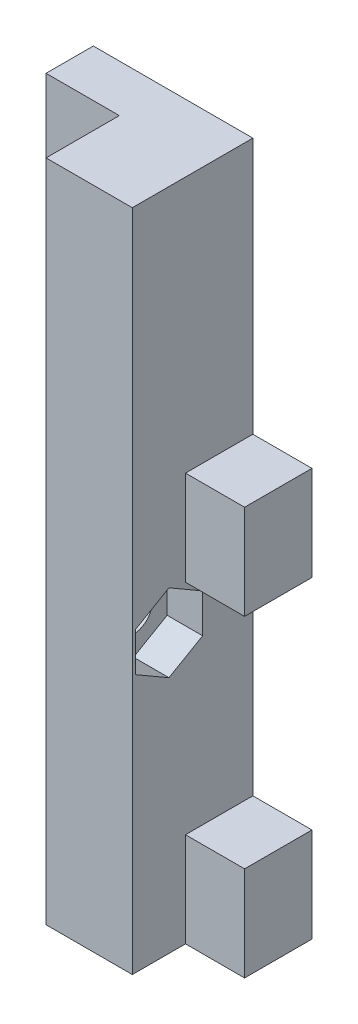
ISO-10303-21;
HEADER;
FILE_DESCRIPTION(('STEP AP214'),'2;1');
FILE_NAME('part.step','',(''),(''),'','','');
FILE_SCHEMA(('AUTOMOTIVE_DESIGN { 1 0 10303 214 1 1 1 1 }'));
ENDSEC;
DATA;
#1=APPLICATION_CONTEXT('core data for automotive mechanical design processes');
#2=APPLICATION_PROTOCOL_DEFINITION('international standard','automotive_design',2000,#1);
#3=PRODUCT_CONTEXT('',#1,'mechanical');
#4=PRODUCT('Part','Part','',(#3));
#5=PRODUCT_RELATED_PRODUCT_CATEGORY('part','',(#4));
#6=PRODUCT_DEFINITION_FORMATION('','',#4);
#7=PRODUCT_DEFINITION_CONTEXT('part definition',#1,'design');
#8=PRODUCT_DEFINITION('design','',#6,#7);
#9=PRODUCT_DEFINITION_SHAPE('','',#8);
#10=(LENGTH_UNIT() NAMED_UNIT(*) SI_UNIT(.MILLI.,.METRE.));
#11=(NAMED_UNIT(*) PLANE_ANGLE_UNIT() SI_UNIT($,.RADIAN.));
#12=(NAMED_UNIT(*) SI_UNIT($,.STERADIAN.) SOLID_ANGLE_UNIT());
#13=UNCERTAINTY_MEASURE_WITH_UNIT(LENGTH_MEASURE(1.E-05),#10,'distance_accuracy_value','');
#14=(GEOMETRIC_REPRESENTATION_CONTEXT(3) GLOBAL_UNCERTAINTY_ASSIGNED_CONTEXT((#13)) GLOBAL_UNIT_ASSIGNED_CONTEXT((#10,
#11,#12)) REPRESENTATION_CONTEXT('',''));
#15=CARTESIAN_POINT('',(0.,0.,0.));
#16=DIRECTION('',(0.,0.,1.));
#17=DIRECTION('',(1.,0.,0.));
#18=AXIS2_PLACEMENT_3D('',#15,#16,#17);
#19=CARTESIAN_POINT('',(0.,34.5,4.));
#20=DIRECTION('',(0.,-1.,0.));
#21=DIRECTION('',(0.,0.,-1.));
#22=AXIS2_PLACEMENT_3D('',#19,#20,#21);
#23=PLANE('',#22);
#24=DIRECTION('',(0.,0.,-1.));
#25=VECTOR('',#24,1.);
#26=CARTESIAN_POINT('',(13.5,34.5,5.7));
#27=LINE('',#26,#25);
#28=CARTESIAN_POINT('',(13.5,34.5,5.7));
#29=VERTEX_POINT('',#28);
#30=CARTESIAN_POINT('',(13.5,34.5,0.));
#31=VERTEX_POINT('',#30);
#32=EDGE_CURVE('E11',#29,#31,#27,.T.);
#33=ORIENTED_EDGE('',*,*,#32,.F.);
#34=DIRECTION('',(-1.,0.,0.));
#35=VECTOR('',#34,1.);
#36=CARTESIAN_POINT('',(18.5,34.5,5.7));
#37=LINE('',#36,#35);
#38=CARTESIAN_POINT('',(18.5,34.5,5.7));
#39=VERTEX_POINT('',#38);
#40=EDGE_CURVE('E400',#39,#29,#37,.T.);
#41=ORIENTED_EDGE('',*,*,#40,.F.);
#42=DIRECTION('',(0.,0.,-1.));
#43=VECTOR('',#42,1.);
#44=CARTESIAN_POINT('',(18.5,34.5,4.));
#45=LINE('',#44,#43);
#46=CARTESIAN_POINT('',(18.5,34.5,0.));
#47=VERTEX_POINT('',#46);
#48=EDGE_CURVE('E381',#39,#47,#45,.T.);
#49=ORIENTED_EDGE('',*,*,#48,.T.);
#50=DIRECTION('',(-1.,0.,0.));
#51=VECTOR('',#50,1.);
#52=CARTESIAN_POINT('',(0.,34.5,0.));
#53=LINE('',#52,#51);
#54=EDGE_CURVE('E175',#47,#31,#53,.T.);
#55=ORIENTED_EDGE('',*,*,#54,.T.);
#56=EDGE_LOOP('',(#33,#41,#49,#55));
#57=FACE_BOUND('',#56,.T.);
#58=ADVANCED_FACE('F31',(#57),#23,.F.);
#59=CARTESIAN_POINT('',(-0.00102500000000172,23.5,7.1));
#60=DIRECTION('',(1.,0.,0.));
#61=DIRECTION('',(0.,1.,0.));
#62=AXIS2_PLACEMENT_3D('',#59,#60,#61);
#63=CYLINDRICAL_SURFACE('',#62,1.6);
#64=CARTESIAN_POINT('',(6.2,23.5,7.1));
#65=DIRECTION('',(1.,0.,0.));
#66=DIRECTION('',(0.,1.,0.));
#67=AXIS2_PLACEMENT_3D('',#64,#65,#66);
#68=CIRCLE('',#67,1.6);
#69=CARTESIAN_POINT('',(6.2,25.1,7.1));
#70=VERTEX_POINT('',#69);
#71=EDGE_CURVE('E245',#70,#70,#68,.F.);
#72=ORIENTED_EDGE('',*,*,#71,.T.);
#73=EDGE_LOOP('',(#72));
#74=FACE_BOUND('',#73,.T.);
#75=CARTESIAN_POINT('',(10.5,23.5,7.1));
#76=DIRECTION('',(1.,0.,0.));
#77=DIRECTION('',(0.,0.,-1.));
#78=AXIS2_PLACEMENT_3D('',#75,#76,#77);
#79=CIRCLE('',#78,1.6);
#80=CARTESIAN_POINT('',(10.5,23.5,5.5));
#81=VERTEX_POINT('',#80);
#82=EDGE_CURVE('E234',#81,#81,#79,.F.);
#83=ORIENTED_EDGE('',*,*,#82,.F.);
#84=EDGE_LOOP('',(#83));
#85=FACE_BOUND('',#84,.T.);
#86=ADVANCED_FACE('F298',(#74,#85),#63,.F.);
#87=CARTESIAN_POINT('',(6.2,34.5,5.7));
#88=DIRECTION('',(0.,0.,1.));
#89=DIRECTION('',(1.,0.,0.));
#90=AXIS2_PLACEMENT_3D('',#87,#88,#89);
#91=PLANE('',#90);
#92=DIRECTION('',(0.,1.,0.));
#93=VECTOR('',#92,1.);
#94=CARTESIAN_POINT('',(13.5,0.,5.7));
#95=LINE('',#94,#93);
#96=CARTESIAN_POINT('',(13.5,0.,5.7));
#97=VERTEX_POINT('',#96);
#98=CARTESIAN_POINT('',(13.5,8.,5.7));
#99=VERTEX_POINT('',#98);
#100=EDGE_CURVE('E56',#97,#99,#95,.T.);
#101=ORIENTED_EDGE('',*,*,#100,.F.);
#102=DIRECTION('',(1.,0.,0.));
#103=VECTOR('',#102,1.);
#104=CARTESIAN_POINT('',(6.2,0.,5.7));
#105=LINE('',#104,#103);
#106=CARTESIAN_POINT('',(18.5,0.,5.7));
#107=VERTEX_POINT('',#106);
#108=EDGE_CURVE('E264',#97,#107,#105,.T.);
#109=ORIENTED_EDGE('',*,*,#108,.T.);
#110=DIRECTION('',(0.,1.,0.));
#111=VECTOR('',#110,1.);
#112=CARTESIAN_POINT('',(18.5,0.,5.7));
#113=LINE('',#112,#111);
#114=CARTESIAN_POINT('',(18.5,8.,5.7));
#115=VERTEX_POINT('',#114);
#116=EDGE_CURVE('E287',#107,#115,#113,.T.);
#117=ORIENTED_EDGE('',*,*,#116,.T.);
#118=DIRECTION('',(-1.,0.,0.));
#119=VECTOR('',#118,1.);
#120=CARTESIAN_POINT('',(18.5,8.,5.7));
#121=LINE('',#120,#119);
#122=EDGE_CURVE('E278',#115,#99,#121,.T.);
#123=ORIENTED_EDGE('',*,*,#122,.T.);
#124=EDGE_LOOP('',(#101,#109,#117,#123));
#125=FACE_BOUND('',#124,.T.);
#126=ADVANCED_FACE('F300',(#125),#91,.T.);
#127=CARTESIAN_POINT('',(0.,34.5,4.));
#128=DIRECTION('',(0.,0.,-1.));
#129=DIRECTION('',(-1.,0.,0.));
#130=AXIS2_PLACEMENT_3D('',#127,#128,#129);
#131=PLANE('',#130);
#132=DIRECTION('',(0.,-1.,0.));
#133=VECTOR('',#132,1.);
#134=CARTESIAN_POINT('',(6.2,34.5,4.));
#135=LINE('',#134,#133);
#136=CARTESIAN_POINT('',(6.2,56.2,4.));
#137=VERTEX_POINT('',#136);
#138=CARTESIAN_POINT('',(6.2,0.,4.));
#139=VERTEX_POINT('',#138);
#140=EDGE_CURVE('E181',#137,#139,#135,.T.);
#141=ORIENTED_EDGE('',*,*,#140,.F.);
#142=DIRECTION('',(1.,0.,0.));
#143=VECTOR('',#142,1.);
#144=CARTESIAN_POINT('',(0.,56.2,4.));
#145=LINE('',#144,#143);
#146=CARTESIAN_POINT('',(0.,56.2,4.));
#147=VERTEX_POINT('',#146);
#148=EDGE_CURVE('E178',#147,#137,#145,.T.);
#149=ORIENTED_EDGE('',*,*,#148,.F.);
#150=DIRECTION('',(0.,-1.,0.));
#151=VECTOR('',#150,1.);
#152=CARTESIAN_POINT('',(0.,0.,4.));
#153=LINE('',#152,#151);
#154=CARTESIAN_POINT('',(0.,0.,4.));
#155=VERTEX_POINT('',#154);
#156=EDGE_CURVE('E166',#147,#155,#153,.T.);
#157=ORIENTED_EDGE('',*,*,#156,.T.);
#158=DIRECTION('',(1.,0.,0.));
#159=VECTOR('',#158,1.);
#160=CARTESIAN_POINT('',(0.,0.,4.));
#161=LINE('',#160,#159);
#162=EDGE_CURVE('E174',#155,#139,#161,.T.);
#163=ORIENTED_EDGE('',*,*,#162,.T.);
#164=EDGE_LOOP('',(#141,#149,#157,#163));
#165=FACE_BOUND('',#164,.T.);
#166=ADVANCED_FACE('F179',(#165),#131,.F.);
#167=CARTESIAN_POINT('',(0.,0.,4.));
#168=DIRECTION('',(1.,0.,0.));
#169=DIRECTION('',(0.,0.,-1.));
#170=AXIS2_PLACEMENT_3D('',#167,#168,#169);
#171=PLANE('',#170);
#172=DIRECTION('',(0.,-1.,0.));
#173=VECTOR('',#172,1.);
#174=CARTESIAN_POINT('',(0.,0.,0.));
#175=LINE('',#174,#173);
#176=CARTESIAN_POINT('',(0.,56.2,0.));
#177=VERTEX_POINT('',#176);
#178=CARTESIAN_POINT('',(0.,0.,0.));
#179=VERTEX_POINT('',#178);
#180=EDGE_CURVE('E362',#177,#179,#175,.T.);
#181=ORIENTED_EDGE('',*,*,#180,.T.);
#182=DIRECTION('',(0.,0.,-1.));
#183=VECTOR('',#182,1.);
#184=CARTESIAN_POINT('',(0.,0.,4.));
#185=LINE('',#184,#183);
#186=EDGE_CURVE('E172',#155,#179,#185,.T.);
#187=ORIENTED_EDGE('',*,*,#186,.F.);
#188=ORIENTED_EDGE('',*,*,#156,.F.);
#189=DIRECTION('',(0.,0.,1.));
#190=VECTOR('',#189,1.);
#191=CARTESIAN_POINT('',(0.,56.2,0.));
#192=LINE('',#191,#190);
#193=EDGE_CURVE('E170',#177,#147,#192,.T.);
#194=ORIENTED_EDGE('',*,*,#193,.F.);
#195=EDGE_LOOP('',(#181,#187,#188,#194));
#196=FACE_BOUND('',#195,.T.);
#197=ADVANCED_FACE('F33',(#196),#171,.F.);
#198=CARTESIAN_POINT('',(0.,0.,4.));
#199=DIRECTION('',(0.,1.,0.));
#200=DIRECTION('',(0.,0.,1.));
#201=AXIS2_PLACEMENT_3D('',#198,#199,#200);
#202=PLANE('',#201);
#203=DIRECTION('',(1.,0.,0.));
#204=VECTOR('',#203,1.);
#205=CARTESIAN_POINT('',(0.,0.,0.));
#206=LINE('',#205,#204);
#207=CARTESIAN_POINT('',(18.5,0.,0.));
#208=VERTEX_POINT('',#207);
#209=EDGE_CURVE('E356',#179,#208,#206,.T.);
#210=ORIENTED_EDGE('',*,*,#209,.T.);
#211=DIRECTION('',(0.,0.,-1.));
#212=VECTOR('',#211,1.);
#213=CARTESIAN_POINT('',(18.5,0.,4.));
#214=LINE('',#213,#212);
#215=EDGE_CURVE('E358',#107,#208,#214,.T.);
#216=ORIENTED_EDGE('',*,*,#215,.F.);
#217=ORIENTED_EDGE('',*,*,#108,.F.);
#218=DIRECTION('',(0.,0.,-1.));
#219=VECTOR('',#218,1.);
#220=CARTESIAN_POINT('',(13.5,0.,10.2));
#221=LINE('',#220,#219);
#222=CARTESIAN_POINT('',(13.5,0.,10.2));
#223=VERTEX_POINT('',#222);
#224=EDGE_CURVE('E255',#223,#97,#221,.T.);
#225=ORIENTED_EDGE('',*,*,#224,.F.);
#226=DIRECTION('',(1.,0.,0.));
#227=VECTOR('',#226,1.);
#228=CARTESIAN_POINT('',(6.2,0.,10.2));
#229=LINE('',#228,#227);
#230=CARTESIAN_POINT('',(6.2,0.,10.2));
#231=VERTEX_POINT('',#230);
#232=EDGE_CURVE('E251',#231,#223,#229,.T.);
#233=ORIENTED_EDGE('',*,*,#232,.F.);
#234=DIRECTION('',(0.,0.,-1.));
#235=VECTOR('',#234,1.);
#236=CARTESIAN_POINT('',(6.2,0.,5.7));
#237=LINE('',#236,#235);
#238=EDGE_CURVE('E393',#231,#139,#237,.T.);
#239=ORIENTED_EDGE('',*,*,#238,.T.);
#240=ORIENTED_EDGE('',*,*,#162,.F.);
#241=ORIENTED_EDGE('',*,*,#186,.T.);
#242=EDGE_LOOP('',(#210,#216,#217,#225,#233,#239,#240,#241));
#243=FACE_BOUND('',#242,.T.);
#244=ADVANCED_FACE('F348',(#243),#202,.F.);
#245=CARTESIAN_POINT('',(18.5,0.,4.));
#246=DIRECTION('',(-1.,0.,0.));
#247=DIRECTION('',(0.,0.,1.));
#248=AXIS2_PLACEMENT_3D('',#245,#246,#247);
#249=PLANE('',#248);
#250=DIRECTION('',(0.,1.,0.));
#251=VECTOR('',#250,1.);
#252=CARTESIAN_POINT('',(18.5,0.,0.));
#253=LINE('',#252,#251);
#254=CARTESIAN_POINT('',(18.5,8.,0.));
#255=VERTEX_POINT('',#254);
#256=EDGE_CURVE('E361',#208,#255,#253,.T.);
#257=ORIENTED_EDGE('',*,*,#256,.T.);
#258=DIRECTION('',(0.,0.,-1.));
#259=VECTOR('',#258,1.);
#260=CARTESIAN_POINT('',(18.5,8.,4.));
#261=LINE('',#260,#259);
#262=EDGE_CURVE('E283',#115,#255,#261,.T.);
#263=ORIENTED_EDGE('',*,*,#262,.F.);
#264=ORIENTED_EDGE('',*,*,#116,.F.);
#265=ORIENTED_EDGE('',*,*,#215,.T.);
#266=EDGE_LOOP('',(#257,#263,#264,#265));
#267=FACE_BOUND('',#266,.T.);
#268=ADVANCED_FACE('F345',(#267),#249,.F.);
#269=CARTESIAN_POINT('',(18.5,8.,4.));
#270=DIRECTION('',(0.,-1.,0.));
#271=DIRECTION('',(0.,0.,-1.));
#272=AXIS2_PLACEMENT_3D('',#269,#270,#271);
#273=PLANE('',#272);
#274=DIRECTION('',(-1.,0.,0.));
#275=VECTOR('',#274,1.);
#276=CARTESIAN_POINT('',(18.5,8.,0.));
#277=LINE('',#276,#275);
#278=CARTESIAN_POINT('',(13.5,8.,0.));
#279=VERTEX_POINT('',#278);
#280=EDGE_CURVE('E369',#255,#279,#277,.T.);
#281=ORIENTED_EDGE('',*,*,#280,.T.);
#282=DIRECTION('',(0.,0.,-1.));
#283=VECTOR('',#282,1.);
#284=CARTESIAN_POINT('',(13.5,8.,4.));
#285=LINE('',#284,#283);
#286=EDGE_CURVE('E270',#99,#279,#285,.T.);
#287=ORIENTED_EDGE('',*,*,#286,.F.);
#288=ORIENTED_EDGE('',*,*,#122,.F.);
#289=ORIENTED_EDGE('',*,*,#262,.T.);
#290=EDGE_LOOP('',(#281,#287,#288,#289));
#291=FACE_BOUND('',#290,.T.);
#292=ADVANCED_FACE('F341',(#291),#273,.F.);
#293=CARTESIAN_POINT('',(13.5,26.5,4.));
#294=DIRECTION('',(-1.,0.,0.));
#295=DIRECTION('',(0.,-1.,0.));
#296=AXIS2_PLACEMENT_3D('',#293,#294,#295);
#297=PLANE('',#296);
#298=DIRECTION('',(0.,-0.5,0.866025403784438));
#299=VECTOR('',#298,1.);
#300=CARTESIAN_POINT('',(13.5,26.7908965343809,7.1));
#301=LINE('',#300,#299);
#302=CARTESIAN_POINT('',(13.5,26.7908965343809,7.1));
#303=VERTEX_POINT('',#302);
#304=CARTESIAN_POINT('',(13.5,25.1454482671904,9.95));
#305=VERTEX_POINT('',#304);
#306=EDGE_CURVE('E212',#303,#305,#301,.T.);
#307=ORIENTED_EDGE('',*,*,#306,.F.);
#308=DIRECTION('',(0.,0.499999999999999,0.866025403784439));
#309=VECTOR('',#308,1.);
#310=CARTESIAN_POINT('',(13.5,25.1454482671904,4.25));
#311=LINE('',#310,#309);
#312=CARTESIAN_POINT('',(13.5,25.1454482671904,4.25));
#313=VERTEX_POINT('',#312);
#314=EDGE_CURVE('E48',#313,#303,#311,.T.);
#315=ORIENTED_EDGE('',*,*,#314,.F.);
#316=DIRECTION('',(0.,1.,0.));
#317=VECTOR('',#316,1.);
#318=CARTESIAN_POINT('',(13.5,21.8545517328096,4.25));
#319=LINE('',#318,#317);
#320=CARTESIAN_POINT('',(13.5,21.8545517328096,4.25));
#321=VERTEX_POINT('',#320);
#322=EDGE_CURVE('E229',#321,#313,#319,.T.);
#323=ORIENTED_EDGE('',*,*,#322,.F.);
#324=DIRECTION('',(0.,0.5,-0.866025403784439));
#325=VECTOR('',#324,1.);
#326=CARTESIAN_POINT('',(13.5,20.2091034656191,7.1));
#327=LINE('',#326,#325);
#328=CARTESIAN_POINT('',(13.5,20.2091034656191,7.1));
#329=VERTEX_POINT('',#328);
#330=EDGE_CURVE('E226',#329,#321,#327,.T.);
#331=ORIENTED_EDGE('',*,*,#330,.F.);
#332=DIRECTION('',(0.,-0.5,-0.866025403784439));
#333=VECTOR('',#332,1.);
#334=CARTESIAN_POINT('',(13.5,21.8545517328096,9.95));
#335=LINE('',#334,#333);
#336=CARTESIAN_POINT('',(13.5,21.8545517328096,9.95));
#337=VERTEX_POINT('',#336);
#338=EDGE_CURVE('E223',#337,#329,#335,.T.);
#339=ORIENTED_EDGE('',*,*,#338,.F.);
#340=DIRECTION('',(0.,-1.,0.));
#341=VECTOR('',#340,1.);
#342=CARTESIAN_POINT('',(13.5,25.1454482671904,9.95));
#343=LINE('',#342,#341);
#344=EDGE_CURVE('E215',#305,#337,#343,.T.);
#345=ORIENTED_EDGE('',*,*,#344,.F.);
#346=EDGE_LOOP('',(#307,#315,#323,#331,#339,#345));
#347=FACE_BOUND('',#346,.T.);
#348=DIRECTION('',(0.,1.,0.));
#349=VECTOR('',#348,1.);
#350=CARTESIAN_POINT('',(13.5,26.5,0.));
#351=LINE('',#350,#349);
#352=CARTESIAN_POINT('',(13.5,26.5,0.));
#353=VERTEX_POINT('',#352);
#354=EDGE_CURVE('E371',#279,#353,#351,.T.);
#355=ORIENTED_EDGE('',*,*,#354,.T.);
#356=DIRECTION('',(0.,0.,-1.));
#357=VECTOR('',#356,1.);
#358=CARTESIAN_POINT('',(13.5,26.5,4.));
#359=LINE('',#358,#357);
#360=CARTESIAN_POINT('',(13.5,26.5,5.7));
#361=VERTEX_POINT('',#360);
#362=EDGE_CURVE('E267',#361,#353,#359,.T.);
#363=ORIENTED_EDGE('',*,*,#362,.F.);
#364=EDGE_CURVE('E40',#361,#29,#95,.T.);
#365=ORIENTED_EDGE('',*,*,#364,.T.);
#366=ORIENTED_EDGE('',*,*,#32,.T.);
#367=DIRECTION('',(0.,-1.,0.));
#368=VECTOR('',#367,1.);
#369=CARTESIAN_POINT('',(13.5,56.2,0.));
#370=LINE('',#369,#368);
#371=CARTESIAN_POINT('',(13.5,56.2,0.));
#372=VERTEX_POINT('',#371);
#373=EDGE_CURVE('E200',#372,#31,#370,.T.);
#374=ORIENTED_EDGE('',*,*,#373,.F.);
#375=DIRECTION('',(0.,0.,-1.));
#376=VECTOR('',#375,1.);
#377=CARTESIAN_POINT('',(13.5,56.2,10.2));
#378=LINE('',#377,#376);
#379=CARTESIAN_POINT('',(13.5,56.2,10.2));
#380=VERTEX_POINT('',#379);
#381=EDGE_CURVE('E197',#380,#372,#378,.T.);
#382=ORIENTED_EDGE('',*,*,#381,.F.);
#383=DIRECTION('',(0.,1.,0.));
#384=VECTOR('',#383,1.);
#385=CARTESIAN_POINT('',(13.5,0.,10.2));
#386=LINE('',#385,#384);
#387=EDGE_CURVE('E253',#223,#380,#386,.T.);
#388=ORIENTED_EDGE('',*,*,#387,.F.);
#389=ORIENTED_EDGE('',*,*,#224,.T.);
#390=ORIENTED_EDGE('',*,*,#100,.T.);
#391=ORIENTED_EDGE('',*,*,#286,.T.);
#392=EDGE_LOOP('',(#355,#363,#365,#366,#374,#382,#388,#389,#390,#391));
#393=FACE_BOUND('',#392,.T.);
#394=ADVANCED_FACE('F337',(#347,#393),#297,.F.);
#395=CARTESIAN_POINT('',(18.5,26.5,4.));
#396=DIRECTION('',(0.,1.,0.));
#397=DIRECTION('',(0.,0.,1.));
#398=AXIS2_PLACEMENT_3D('',#395,#396,#397);
#399=PLANE('',#398);
#400=DIRECTION('',(1.,0.,0.));
#401=VECTOR('',#400,1.);
#402=CARTESIAN_POINT('',(18.5,26.5,0.));
#403=LINE('',#402,#401);
#404=CARTESIAN_POINT('',(18.5,26.5,0.));
#405=VERTEX_POINT('',#404);
#406=EDGE_CURVE('E376',#353,#405,#403,.T.);
#407=ORIENTED_EDGE('',*,*,#406,.T.);
#408=DIRECTION('',(0.,0.,-1.));
#409=VECTOR('',#408,1.);
#410=CARTESIAN_POINT('',(18.5,26.5,4.));
#411=LINE('',#410,#409);
#412=CARTESIAN_POINT('',(18.5,26.5,5.7));
#413=VERTEX_POINT('',#412);
#414=EDGE_CURVE('E271',#413,#405,#411,.T.);
#415=ORIENTED_EDGE('',*,*,#414,.F.);
#416=DIRECTION('',(1.,0.,0.));
#417=VECTOR('',#416,1.);
#418=CARTESIAN_POINT('',(13.5,26.5,5.7));
#419=LINE('',#418,#417);
#420=EDGE_CURVE('E274',#361,#413,#419,.T.);
#421=ORIENTED_EDGE('',*,*,#420,.F.);
#422=ORIENTED_EDGE('',*,*,#362,.T.);
#423=EDGE_LOOP('',(#407,#415,#421,#422));
#424=FACE_BOUND('',#423,.T.);
#425=ADVANCED_FACE('F333',(#424),#399,.F.);
#426=CARTESIAN_POINT('',(18.5,26.5,4.));
#427=DIRECTION('',(-1.,0.,0.));
#428=DIRECTION('',(0.,0.,1.));
#429=AXIS2_PLACEMENT_3D('',#426,#427,#428);
#430=PLANE('',#429);
#431=DIRECTION('',(0.,1.,0.));
#432=VECTOR('',#431,1.);
#433=CARTESIAN_POINT('',(18.5,26.5,0.));
#434=LINE('',#433,#432);
#435=EDGE_CURVE('E378',#405,#47,#434,.T.);
#436=ORIENTED_EDGE('',*,*,#435,.T.);
#437=ORIENTED_EDGE('',*,*,#48,.F.);
#438=DIRECTION('',(0.,1.,0.));
#439=VECTOR('',#438,1.);
#440=CARTESIAN_POINT('',(18.5,26.5,5.7));
#441=LINE('',#440,#439);
#442=EDGE_CURVE('E277',#413,#39,#441,.T.);
#443=ORIENTED_EDGE('',*,*,#442,.F.);
#444=ORIENTED_EDGE('',*,*,#414,.T.);
#445=EDGE_LOOP('',(#436,#437,#443,#444));
#446=FACE_BOUND('',#445,.T.);
#447=ADVANCED_FACE('F329',(#446),#430,.F.);
#448=CARTESIAN_POINT('',(0.,34.5,0.));
#449=DIRECTION('',(0.,0.,-1.));
#450=DIRECTION('',(-1.,0.,0.));
#451=AXIS2_PLACEMENT_3D('',#448,#449,#450);
#452=PLANE('',#451);
#453=ORIENTED_EDGE('',*,*,#180,.F.);
#454=DIRECTION('',(-1.,0.,0.));
#455=VECTOR('',#454,1.);
#456=CARTESIAN_POINT('',(13.5,56.2,0.));
#457=LINE('',#456,#455);
#458=EDGE_CURVE('E190',#372,#177,#457,.T.);
#459=ORIENTED_EDGE('',*,*,#458,.F.);
#460=ORIENTED_EDGE('',*,*,#373,.T.);
#461=ORIENTED_EDGE('',*,*,#54,.F.);
#462=ORIENTED_EDGE('',*,*,#435,.F.);
#463=ORIENTED_EDGE('',*,*,#406,.F.);
#464=ORIENTED_EDGE('',*,*,#354,.F.);
#465=ORIENTED_EDGE('',*,*,#280,.F.);
#466=ORIENTED_EDGE('',*,*,#256,.F.);
#467=ORIENTED_EDGE('',*,*,#209,.F.);
#468=EDGE_LOOP('',(#453,#459,#460,#461,#462,#463,#464,#465,#466,#467));
#469=FACE_BOUND('',#468,.T.);
#470=ADVANCED_FACE('F324',(#469),#452,.T.);
#471=CARTESIAN_POINT('',(6.2,34.5,5.7));
#472=DIRECTION('',(1.,0.,0.));
#473=DIRECTION('',(0.,1.,0.));
#474=AXIS2_PLACEMENT_3D('',#471,#472,#473);
#475=PLANE('',#474);
#476=ORIENTED_EDGE('',*,*,#71,.F.);
#477=EDGE_LOOP('',(#476));
#478=FACE_BOUND('',#477,.T.);
#479=ORIENTED_EDGE('',*,*,#140,.T.);
#480=ORIENTED_EDGE('',*,*,#238,.F.);
#481=DIRECTION('',(0.,-1.,0.));
#482=VECTOR('',#481,1.);
#483=CARTESIAN_POINT('',(6.2,0.,10.2));
#484=LINE('',#483,#482);
#485=CARTESIAN_POINT('',(6.2,56.2,10.2));
#486=VERTEX_POINT('',#485);
#487=EDGE_CURVE('E248',#486,#231,#484,.T.);
#488=ORIENTED_EDGE('',*,*,#487,.F.);
#489=DIRECTION('',(0.,0.,1.));
#490=VECTOR('',#489,1.);
#491=CARTESIAN_POINT('',(6.2,56.2,4.));
#492=LINE('',#491,#490);
#493=EDGE_CURVE('E185',#137,#486,#492,.T.);
#494=ORIENTED_EDGE('',*,*,#493,.F.);
#495=EDGE_LOOP('',(#479,#480,#488,#494));
#496=FACE_BOUND('',#495,.T.);
#497=ADVANCED_FACE('F320',(#478,#496),#475,.F.);
#498=ORIENTED_EDGE('',*,*,#364,.F.);
#499=ORIENTED_EDGE('',*,*,#420,.T.);
#500=ORIENTED_EDGE('',*,*,#442,.T.);
#501=ORIENTED_EDGE('',*,*,#40,.T.);
#502=EDGE_LOOP('',(#498,#499,#500,#501));
#503=FACE_BOUND('',#502,.T.);
#504=ADVANCED_FACE('F308',(#503),#91,.T.);
#505=CARTESIAN_POINT('',(6.2,34.5,10.2));
#506=DIRECTION('',(0.,0.,-1.));
#507=DIRECTION('',(-1.,0.,0.));
#508=AXIS2_PLACEMENT_3D('',#505,#506,#507);
#509=PLANE('',#508);
#510=ORIENTED_EDGE('',*,*,#487,.T.);
#511=ORIENTED_EDGE('',*,*,#232,.T.);
#512=ORIENTED_EDGE('',*,*,#387,.T.);
#513=DIRECTION('',(1.,0.,0.));
#514=VECTOR('',#513,1.);
#515=CARTESIAN_POINT('',(6.2,56.2,10.2));
#516=LINE('',#515,#514);
#517=EDGE_CURVE('E194',#486,#380,#516,.T.);
#518=ORIENTED_EDGE('',*,*,#517,.F.);
#519=EDGE_LOOP('',(#510,#511,#512,#518));
#520=FACE_BOUND('',#519,.T.);
#521=ADVANCED_FACE('F315',(#520),#509,.F.);
#522=CARTESIAN_POINT('',(10.5,26.7908965343809,7.1));
#523=DIRECTION('',(1.,0.,0.));
#524=DIRECTION('',(0.,0.,-1.));
#525=AXIS2_PLACEMENT_3D('',#522,#523,#524);
#526=PLANE('',#525);
#527=DIRECTION('',(0.,0.499999999999999,0.866025403784439));
#528=VECTOR('',#527,1.);
#529=CARTESIAN_POINT('',(10.5,25.1454482671904,4.25));
#530=LINE('',#529,#528);
#531=CARTESIAN_POINT('',(10.5,25.1454482671904,4.25));
#532=VERTEX_POINT('',#531);
#533=CARTESIAN_POINT('',(10.5,26.7908965343809,7.1));
#534=VERTEX_POINT('',#533);
#535=EDGE_CURVE('E203',#532,#534,#530,.T.);
#536=ORIENTED_EDGE('',*,*,#535,.T.);
#537=DIRECTION('',(0.,-0.5,0.866025403784438));
#538=VECTOR('',#537,1.);
#539=CARTESIAN_POINT('',(10.5,26.7908965343809,7.1));
#540=LINE('',#539,#538);
#541=CARTESIAN_POINT('',(10.5,25.1454482671904,9.95));
#542=VERTEX_POINT('',#541);
#543=EDGE_CURVE('E644',#534,#542,#540,.T.);
#544=ORIENTED_EDGE('',*,*,#543,.T.);
#545=DIRECTION('',(0.,-1.,0.));
#546=VECTOR('',#545,1.);
#547=CARTESIAN_POINT('',(10.5,25.1454482671904,9.95));
#548=LINE('',#547,#546);
#549=CARTESIAN_POINT('',(10.5,21.8545517328096,9.95));
#550=VERTEX_POINT('',#549);
#551=EDGE_CURVE('E640',#542,#550,#548,.T.);
#552=ORIENTED_EDGE('',*,*,#551,.T.);
#553=DIRECTION('',(0.,-0.5,-0.866025403784439));
#554=VECTOR('',#553,1.);
#555=CARTESIAN_POINT('',(10.5,21.8545517328096,9.95));
#556=LINE('',#555,#554);
#557=CARTESIAN_POINT('',(10.5,20.2091034656191,7.1));
#558=VERTEX_POINT('',#557);
#559=EDGE_CURVE('E643',#550,#558,#556,.T.);
#560=ORIENTED_EDGE('',*,*,#559,.T.);
#561=DIRECTION('',(0.,0.5,-0.866025403784439));
#562=VECTOR('',#561,1.);
#563=CARTESIAN_POINT('',(10.5,20.2091034656191,7.1));
#564=LINE('',#563,#562);
#565=CARTESIAN_POINT('',(10.5,21.8545517328096,4.25));
#566=VERTEX_POINT('',#565);
#567=EDGE_CURVE('E650',#558,#566,#564,.T.);
#568=ORIENTED_EDGE('',*,*,#567,.T.);
#569=DIRECTION('',(0.,1.,0.));
#570=VECTOR('',#569,1.);
#571=CARTESIAN_POINT('',(10.5,21.8545517328096,4.25));
#572=LINE('',#571,#570);
#573=EDGE_CURVE('E218',#566,#532,#572,.T.);
#574=ORIENTED_EDGE('',*,*,#573,.T.);
#575=EDGE_LOOP('',(#536,#544,#552,#560,#568,#574));
#576=FACE_BOUND('',#575,.T.);
#577=ORIENTED_EDGE('',*,*,#82,.T.);
#578=EDGE_LOOP('',(#577));
#579=FACE_BOUND('',#578,.T.);
#580=ADVANCED_FACE('F296',(#576,#579),#526,.T.);
#581=CARTESIAN_POINT('',(10.5,25.1454482671904,4.25));
#582=DIRECTION('',(0.,0.866025403784439,-0.499999999999999));
#583=DIRECTION('',(0.,0.499999999999999,0.866025403784439));
#584=AXIS2_PLACEMENT_3D('',#581,#582,#583);
#585=PLANE('',#584);
#586=ORIENTED_EDGE('',*,*,#314,.T.);
#587=DIRECTION('',(1.,0.,0.));
#588=VECTOR('',#587,1.);
#589=CARTESIAN_POINT('',(10.5,26.7908965343809,7.1));
#590=LINE('',#589,#588);
#591=EDGE_CURVE('E243',#534,#303,#590,.T.);
#592=ORIENTED_EDGE('',*,*,#591,.F.);
#593=ORIENTED_EDGE('',*,*,#535,.F.);
#594=DIRECTION('',(1.,0.,0.));
#595=VECTOR('',#594,1.);
#596=CARTESIAN_POINT('',(10.5,25.1454482671904,4.25));
#597=LINE('',#596,#595);
#598=EDGE_CURVE('E232',#532,#313,#597,.T.);
#599=ORIENTED_EDGE('',*,*,#598,.T.);
#600=EDGE_LOOP('',(#586,#592,#593,#599));
#601=FACE_BOUND('',#600,.T.);
#602=ADVANCED_FACE('F313',(#601),#585,.F.);
#603=CARTESIAN_POINT('',(10.5,21.8545517328096,4.25));
#604=DIRECTION('',(0.,0.,-1.));
#605=DIRECTION('',(-1.,0.,0.));
#606=AXIS2_PLACEMENT_3D('',#603,#604,#605);
#607=PLANE('',#606);
#608=ORIENTED_EDGE('',*,*,#322,.T.);
#609=ORIENTED_EDGE('',*,*,#598,.F.);
#610=ORIENTED_EDGE('',*,*,#573,.F.);
#611=DIRECTION('',(1.,0.,0.));
#612=VECTOR('',#611,1.);
#613=CARTESIAN_POINT('',(10.5,21.8545517328096,4.25));
#614=LINE('',#613,#612);
#615=EDGE_CURVE('E235',#566,#321,#614,.T.);
#616=ORIENTED_EDGE('',*,*,#615,.T.);
#617=EDGE_LOOP('',(#608,#609,#610,#616));
#618=FACE_BOUND('',#617,.T.);
#619=ADVANCED_FACE('F481',(#618),#607,.F.);
#620=CARTESIAN_POINT('',(10.5,20.2091034656191,7.1));
#621=DIRECTION('',(0.,-0.866025403784439,-0.5));
#622=DIRECTION('',(0.,0.5,-0.866025403784439));
#623=AXIS2_PLACEMENT_3D('',#620,#621,#622);
#624=PLANE('',#623);
#625=ORIENTED_EDGE('',*,*,#330,.T.);
#626=ORIENTED_EDGE('',*,*,#615,.F.);
#627=ORIENTED_EDGE('',*,*,#567,.F.);
#628=DIRECTION('',(1.,0.,0.));
#629=VECTOR('',#628,1.);
#630=CARTESIAN_POINT('',(10.5,20.2091034656191,7.1));
#631=LINE('',#630,#629);
#632=EDGE_CURVE('E237',#558,#329,#631,.T.);
#633=ORIENTED_EDGE('',*,*,#632,.T.);
#634=EDGE_LOOP('',(#625,#626,#627,#633));
#635=FACE_BOUND('',#634,.T.);
#636=ADVANCED_FACE('F489',(#635),#624,.F.);
#637=CARTESIAN_POINT('',(10.5,21.8545517328096,9.95));
#638=DIRECTION('',(0.,-0.866025403784439,0.5));
#639=DIRECTION('',(0.,-0.5,-0.866025403784439));
#640=AXIS2_PLACEMENT_3D('',#637,#638,#639);
#641=PLANE('',#640);
#642=ORIENTED_EDGE('',*,*,#338,.T.);
#643=ORIENTED_EDGE('',*,*,#632,.F.);
#644=ORIENTED_EDGE('',*,*,#559,.F.);
#645=DIRECTION('',(1.,0.,0.));
#646=VECTOR('',#645,1.);
#647=CARTESIAN_POINT('',(10.5,21.8545517328096,9.95));
#648=LINE('',#647,#646);
#649=EDGE_CURVE('E239',#550,#337,#648,.T.);
#650=ORIENTED_EDGE('',*,*,#649,.T.);
#651=EDGE_LOOP('',(#642,#643,#644,#650));
#652=FACE_BOUND('',#651,.T.);
#653=ADVANCED_FACE('F499',(#652),#641,.F.);
#654=CARTESIAN_POINT('',(10.5,25.1454482671904,9.95));
#655=DIRECTION('',(0.,0.,1.));
#656=DIRECTION('',(1.,0.,0.));
#657=AXIS2_PLACEMENT_3D('',#654,#655,#656);
#658=PLANE('',#657);
#659=ORIENTED_EDGE('',*,*,#344,.T.);
#660=ORIENTED_EDGE('',*,*,#649,.F.);
#661=ORIENTED_EDGE('',*,*,#551,.F.);
#662=DIRECTION('',(1.,0.,0.));
#663=VECTOR('',#662,1.);
#664=CARTESIAN_POINT('',(10.5,25.1454482671904,9.95));
#665=LINE('',#664,#663);
#666=EDGE_CURVE('E241',#542,#305,#665,.T.);
#667=ORIENTED_EDGE('',*,*,#666,.T.);
#668=EDGE_LOOP('',(#659,#660,#661,#667));
#669=FACE_BOUND('',#668,.T.);
#670=ADVANCED_FACE('F509',(#669),#658,.F.);
#671=CARTESIAN_POINT('',(10.5,26.7908965343809,7.1));
#672=DIRECTION('',(0.,0.866025403784438,0.5));
#673=DIRECTION('',(0.,-0.5,0.866025403784438));
#674=AXIS2_PLACEMENT_3D('',#671,#672,#673);
#675=PLANE('',#674);
#676=ORIENTED_EDGE('',*,*,#306,.T.);
#677=ORIENTED_EDGE('',*,*,#666,.F.);
#678=ORIENTED_EDGE('',*,*,#543,.F.);
#679=ORIENTED_EDGE('',*,*,#591,.T.);
#680=EDGE_LOOP('',(#676,#677,#678,#679));
#681=FACE_BOUND('',#680,.T.);
#682=ADVANCED_FACE('F519',(#681),#675,.F.);
#683=CARTESIAN_POINT('',(0.,56.2,4.));
#684=DIRECTION('',(0.,1.,0.));
#685=DIRECTION('',(0.,0.,1.));
#686=AXIS2_PLACEMENT_3D('',#683,#684,#685);
#687=PLANE('',#686);
#688=ORIENTED_EDGE('',*,*,#193,.T.);
#689=ORIENTED_EDGE('',*,*,#148,.T.);
#690=ORIENTED_EDGE('',*,*,#493,.T.);
#691=ORIENTED_EDGE('',*,*,#517,.T.);
#692=ORIENTED_EDGE('',*,*,#381,.T.);
#693=ORIENTED_EDGE('',*,*,#458,.T.);
#694=EDGE_LOOP('',(#688,#689,#690,#691,#692,#693));
#695=FACE_BOUND('',#694,.T.);
#696=ADVANCED_FACE('F188',(#695),#687,.T.);
#697=CLOSED_SHELL('',(#58,#86,#126,#166,#197,#244,#268,#292,#394,#425,#447,#470,#497,#504,#521,
#580,#602,#619,#636,#653,#670,#682,#696));
#698=MANIFOLD_SOLID_BREP('B2',#697);
#699=ADVANCED_BREP_SHAPE_REPRESENTATION('',(#18,#698),#14);
#700=SHAPE_DEFINITION_REPRESENTATION(#9,#699);
ENDSEC;
END-ISO-10303-21;
